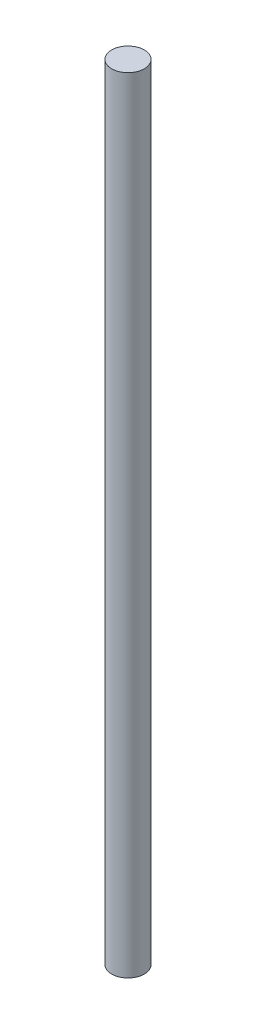
ISO-10303-21;
HEADER;
FILE_DESCRIPTION(('STEP AP214'),'2;1');
FILE_NAME('part.step','',(''),(''),'','','');
FILE_SCHEMA(('AUTOMOTIVE_DESIGN { 1 0 10303 214 1 1 1 1 }'));
ENDSEC;
DATA;
#1=APPLICATION_CONTEXT('core data for automotive mechanical design processes');
#2=APPLICATION_PROTOCOL_DEFINITION('international standard','automotive_design',2000,#1);
#3=PRODUCT_CONTEXT('',#1,'mechanical');
#4=PRODUCT('Part','Part','',(#3));
#5=PRODUCT_RELATED_PRODUCT_CATEGORY('part','',(#4));
#6=PRODUCT_DEFINITION_FORMATION('','',#4);
#7=PRODUCT_DEFINITION_CONTEXT('part definition',#1,'design');
#8=PRODUCT_DEFINITION('design','',#6,#7);
#9=PRODUCT_DEFINITION_SHAPE('','',#8);
#10=(LENGTH_UNIT() NAMED_UNIT(*) SI_UNIT(.MILLI.,.METRE.));
#11=(NAMED_UNIT(*) PLANE_ANGLE_UNIT() SI_UNIT($,.RADIAN.));
#12=(NAMED_UNIT(*) SI_UNIT($,.STERADIAN.) SOLID_ANGLE_UNIT());
#13=UNCERTAINTY_MEASURE_WITH_UNIT(LENGTH_MEASURE(1.E-05),#10,'distance_accuracy_value','');
#14=(GEOMETRIC_REPRESENTATION_CONTEXT(3) GLOBAL_UNCERTAINTY_ASSIGNED_CONTEXT((#13)) GLOBAL_UNIT_ASSIGNED_CONTEXT((#10,
#11,#12)) REPRESENTATION_CONTEXT('',''));
#15=CARTESIAN_POINT('',(0.,0.,0.));
#16=DIRECTION('',(0.,0.,1.));
#17=DIRECTION('',(1.,0.,0.));
#18=AXIS2_PLACEMENT_3D('',#15,#16,#17);
#19=CARTESIAN_POINT('',(0.,304.8,0.));
#20=DIRECTION('',(0.,-1.,0.));
#21=DIRECTION('',(0.,0.,-1.));
#22=AXIS2_PLACEMENT_3D('',#19,#20,#21);
#23=CYLINDRICAL_SURFACE('',#22,6.35);
#24=CARTESIAN_POINT('',(0.,304.8,0.));
#25=DIRECTION('',(0.,1.,0.));
#26=DIRECTION('',(0.,0.,1.));
#27=AXIS2_PLACEMENT_3D('',#24,#25,#26);
#28=CIRCLE('',#27,6.35);
#29=CARTESIAN_POINT('',(0.,304.8,6.35));
#30=VERTEX_POINT('',#29);
#31=EDGE_CURVE('E10',#30,#30,#28,.T.);
#32=ORIENTED_EDGE('',*,*,#31,.F.);
#33=EDGE_LOOP('',(#32));
#34=FACE_BOUND('',#33,.T.);
#35=CARTESIAN_POINT('',(0.,0.,0.));
#36=DIRECTION('',(0.,1.,0.));
#37=DIRECTION('',(0.,0.,1.));
#38=AXIS2_PLACEMENT_3D('',#35,#36,#37);
#39=CIRCLE('',#38,6.35);
#40=CARTESIAN_POINT('',(0.,0.,6.35));
#41=VERTEX_POINT('',#40);
#42=EDGE_CURVE('E39',#41,#41,#39,.T.);
#43=ORIENTED_EDGE('',*,*,#42,.T.);
#44=EDGE_LOOP('',(#43));
#45=FACE_BOUND('',#44,.T.);
#46=ADVANCED_FACE('F36',(#34,#45),#23,.T.);
#47=CARTESIAN_POINT('',(0.,304.8,0.));
#48=DIRECTION('',(0.,1.,0.));
#49=DIRECTION('',(0.,0.,1.));
#50=AXIS2_PLACEMENT_3D('',#47,#48,#49);
#51=PLANE('',#50);
#52=ORIENTED_EDGE('',*,*,#31,.T.);
#53=EDGE_LOOP('',(#52));
#54=FACE_BOUND('',#53,.T.);
#55=ADVANCED_FACE('F51',(#54),#51,.T.);
#56=CARTESIAN_POINT('',(0.,0.,0.));
#57=DIRECTION('',(0.,1.,0.));
#58=DIRECTION('',(0.,0.,1.));
#59=AXIS2_PLACEMENT_3D('',#56,#57,#58);
#60=PLANE('',#59);
#61=ORIENTED_EDGE('',*,*,#42,.F.);
#62=EDGE_LOOP('',(#61));
#63=FACE_BOUND('',#62,.T.);
#64=ADVANCED_FACE('F49',(#63),#60,.F.);
#65=CLOSED_SHELL('',(#46,#55,#64));
#66=MANIFOLD_SOLID_BREP('B2',#65);
#67=ADVANCED_BREP_SHAPE_REPRESENTATION('',(#18,#66),#14);
#68=SHAPE_DEFINITION_REPRESENTATION(#9,#67);
ENDSEC;
END-ISO-10303-21;
